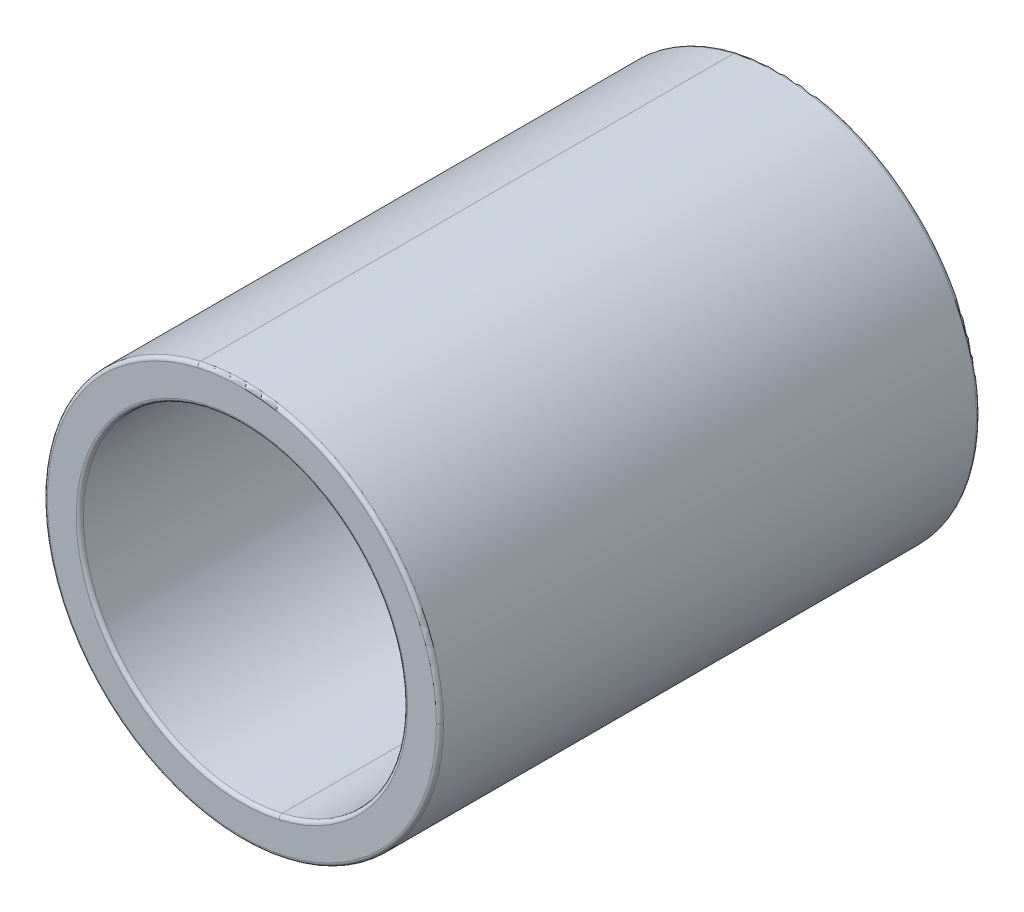
ISO-10303-21;
HEADER;
FILE_DESCRIPTION(('STEP AP214'),'2;1');
FILE_NAME('part.step','',(''),(''),'','','');
FILE_SCHEMA(('AUTOMOTIVE_DESIGN { 1 0 10303 214 1 1 1 1 }'));
ENDSEC;
DATA;
#1=APPLICATION_CONTEXT('core data for automotive mechanical design processes');
#2=APPLICATION_PROTOCOL_DEFINITION('international standard','automotive_design',2000,#1);
#3=PRODUCT_CONTEXT('',#1,'mechanical');
#4=PRODUCT('Part','Part','',(#3));
#5=PRODUCT_RELATED_PRODUCT_CATEGORY('part','',(#4));
#6=PRODUCT_DEFINITION_FORMATION('','',#4);
#7=PRODUCT_DEFINITION_CONTEXT('part definition',#1,'design');
#8=PRODUCT_DEFINITION('design','',#6,#7);
#9=PRODUCT_DEFINITION_SHAPE('','',#8);
#10=(LENGTH_UNIT() NAMED_UNIT(*) SI_UNIT(.MILLI.,.METRE.));
#11=(NAMED_UNIT(*) PLANE_ANGLE_UNIT() SI_UNIT($,.RADIAN.));
#12=(NAMED_UNIT(*) SI_UNIT($,.STERADIAN.) SOLID_ANGLE_UNIT());
#13=UNCERTAINTY_MEASURE_WITH_UNIT(LENGTH_MEASURE(1.E-05),#10,'distance_accuracy_value','');
#14=(GEOMETRIC_REPRESENTATION_CONTEXT(3) GLOBAL_UNCERTAINTY_ASSIGNED_CONTEXT((#13)) GLOBAL_UNIT_ASSIGNED_CONTEXT((#10,
#11,#12)) REPRESENTATION_CONTEXT('',''));
#15=CARTESIAN_POINT('',(0.,0.,0.));
#16=DIRECTION('',(0.,0.,1.));
#17=DIRECTION('',(1.,0.,0.));
#18=AXIS2_PLACEMENT_3D('',#15,#16,#17);
#19=CARTESIAN_POINT('',(-4.21485674493979,0.482044760346951,6.9450118369283));
#20=DIRECTION('',(0.,0.,1.));
#21=DIRECTION('',(1.,0.,0.));
#22=AXIS2_PLACEMENT_3D('',#19,#20,#21);
#23=PLANE('',#22);
#24=CARTESIAN_POINT('',(0.,0.,6.9450118369283));
#25=DIRECTION('',(0.,0.,1.));
#26=DIRECTION('',(0.999993907657791,0.00349065141521904,0.));
#27=AXIS2_PLACEMENT_3D('',#24,#25,#26);
#28=CIRCLE('',#27,5.50000000000044);
#29=CARTESIAN_POINT('',(-5.48726421207944,-0.374074146176042,6.9450118369283));
#30=VERTEX_POINT('',#29);
#31=CARTESIAN_POINT('',(-4.88370567628468,-2.52970726911823,6.9450118369283));
#32=VERTEX_POINT('',#31);
#33=EDGE_CURVE('E325',#30,#32,#28,.T.);
#34=ORIENTED_EDGE('',*,*,#33,.F.);
#35=DIRECTION('',(-0.978412700356879,0.206660561744034,0.));
#36=VECTOR('',#35,1.);
#37=CARTESIAN_POINT('',(-5.53807600239508,-0.363341667820007,6.9450118369283));
#38=LINE('',#37,#36);
#39=CARTESIAN_POINT('',(-5.58888779271072,-0.352609189463972,6.9450118369283));
#40=VERTEX_POINT('',#39);
#41=EDGE_CURVE('E11',#30,#40,#38,.T.);
#42=ORIENTED_EDGE('',*,*,#41,.T.);
#43=CARTESIAN_POINT('',(-4.85790093441127E-13,0.,6.9450118369283));
#44=DIRECTION('',(0.,0.,-1.));
#45=DIRECTION('',(-0.999993907657791,-0.00349065141521904,0.));
#46=AXIS2_PLACEMENT_3D('',#43,#44,#45);
#47=CIRCLE('',#46,5.6);
#48=CARTESIAN_POINT('',(-4.98417477235322,-2.55303776678734,6.9450118369283));
#49=VERTEX_POINT('',#48);
#50=EDGE_CURVE('E296',#49,#40,#47,.T.);
#51=ORIENTED_EDGE('',*,*,#50,.F.);
#52=DIRECTION('',(-0.974081576643637,-0.226196998307772,0.));
#53=VECTOR('',#52,1.);
#54=CARTESIAN_POINT('',(-4.93394022431895,-2.54137251795278,6.9450118369283));
#55=LINE('',#54,#53);
#56=EDGE_CURVE('E253',#32,#49,#55,.T.);
#57=ORIENTED_EDGE('',*,*,#56,.F.);
#58=EDGE_LOOP('',(#34,#42,#51,#57));
#59=FACE_BOUND('',#58,.T.);
#60=ADVANCED_FACE('F16',(#59),#23,.T.);
#61=CARTESIAN_POINT('',(-6.27113821296004,0.47486695480087,4.9450118369283));
#62=DIRECTION('',(0.,0.,-1.));
#63=DIRECTION('',(0.,-1.,0.));
#64=AXIS2_PLACEMENT_3D('',#61,#62,#63);
#65=PLANE('',#64);
#66=DIRECTION('',(0.974081576643637,0.226196998307772,0.));
#67=VECTOR('',#66,1.);
#68=CARTESIAN_POINT('',(-4.93394022431895,-2.54137251795278,4.9450118369283));
#69=LINE('',#68,#67);
#70=CARTESIAN_POINT('',(-4.98417477235322,-2.55303776678734,4.9450118369283));
#71=VERTEX_POINT('',#70);
#72=CARTESIAN_POINT('',(-4.88370567628468,-2.52970726911823,4.9450118369283));
#73=VERTEX_POINT('',#72);
#74=EDGE_CURVE('E266',#71,#73,#69,.T.);
#75=ORIENTED_EDGE('',*,*,#74,.F.);
#76=CARTESIAN_POINT('',(-4.85357172128634E-13,0.,4.9450118369283));
#77=DIRECTION('',(0.,0.,1.));
#78=DIRECTION('',(0.999993907657791,0.00349065141521904,0.));
#79=AXIS2_PLACEMENT_3D('',#76,#77,#78);
#80=CIRCLE('',#79,5.6);
#81=CARTESIAN_POINT('',(-5.58888779271072,-0.352609189463972,4.9450118369283));
#82=VERTEX_POINT('',#81);
#83=EDGE_CURVE('E19',#82,#71,#80,.T.);
#84=ORIENTED_EDGE('',*,*,#83,.F.);
#85=DIRECTION('',(0.978412700356879,-0.206660561744034,0.));
#86=VECTOR('',#85,1.);
#87=CARTESIAN_POINT('',(-5.53807600239508,-0.363341667820007,4.9450118369283));
#88=LINE('',#87,#86);
#89=CARTESIAN_POINT('',(-5.48726421207944,-0.374074146176042,4.9450118369283));
#90=VERTEX_POINT('',#89);
#91=EDGE_CURVE('E25',#82,#90,#88,.T.);
#92=ORIENTED_EDGE('',*,*,#91,.T.);
#93=CARTESIAN_POINT('',(-2.58160494515739E-13,0.,4.9450118369283));
#94=DIRECTION('',(0.,0.,-1.));
#95=DIRECTION('',(-0.999993907657791,-0.00349065141521904,0.));
#96=AXIS2_PLACEMENT_3D('',#93,#94,#95);
#97=CIRCLE('',#96,5.50000000000021);
#98=EDGE_CURVE('E337',#73,#90,#97,.T.);
#99=ORIENTED_EDGE('',*,*,#98,.F.);
#100=EDGE_LOOP('',(#75,#84,#92,#99));
#101=FACE_BOUND('',#100,.T.);
#102=ADVANCED_FACE('F418',(#101),#65,.T.);
#103=CARTESIAN_POINT('',(-4.76867384963161,-0.525854972317365,4.1354118369283));
#104=DIRECTION('',(0.206660561744051,0.978412700356876,0.));
#105=DIRECTION('',(0.,0.,-1.));
#106=AXIS2_PLACEMENT_3D('',#103,#104,#105);
#107=PLANE('',#106);
#108=DIRECTION('',(0.,0.,1.));
#109=VECTOR('',#108,1.);
#110=CARTESIAN_POINT('',(-5.48726421207944,-0.374074146176042,5.9450118369283));
#111=LINE('',#110,#109);
#112=EDGE_CURVE('E341',#90,#30,#111,.T.);
#113=ORIENTED_EDGE('',*,*,#112,.F.);
#114=ORIENTED_EDGE('',*,*,#91,.F.);
#115=DIRECTION('',(0.,0.,-1.));
#116=VECTOR('',#115,1.);
#117=CARTESIAN_POINT('',(-5.58888779271072,-0.352609189463972,5.9450118369283));
#118=LINE('',#117,#116);
#119=EDGE_CURVE('E406',#40,#82,#118,.T.);
#120=ORIENTED_EDGE('',*,*,#119,.F.);
#121=ORIENTED_EDGE('',*,*,#41,.F.);
#122=EDGE_LOOP('',(#113,#114,#120,#121));
#123=FACE_BOUND('',#122,.T.);
#124=ADVANCED_FACE('F425',(#123),#107,.T.);
#125=CARTESIAN_POINT('',(-4.61862460043944E-13,0.,5.9450118369283));
#126=DIRECTION('',(0.,0.,1.));
#127=DIRECTION('',(0.999993907657791,0.00349065141521904,0.));
#128=AXIS2_PLACEMENT_3D('',#125,#126,#127);
#129=CYLINDRICAL_SURFACE('',#128,5.6);
#130=ORIENTED_EDGE('',*,*,#50,.T.);
#131=ORIENTED_EDGE('',*,*,#119,.T.);
#132=ORIENTED_EDGE('',*,*,#83,.T.);
#133=DIRECTION('',(0.,0.,-1.));
#134=VECTOR('',#133,1.);
#135=CARTESIAN_POINT('',(-4.98417477235322,-2.55303776678734,5.9450118369283));
#136=LINE('',#135,#134);
#137=EDGE_CURVE('E257',#49,#71,#136,.T.);
#138=ORIENTED_EDGE('',*,*,#137,.F.);
#139=EDGE_LOOP('',(#130,#131,#132,#138));
#140=FACE_BOUND('',#139,.T.);
#141=ADVANCED_FACE('F415',(#140),#129,.T.);
#142=CARTESIAN_POINT('',(-4.16248771326453,-2.36222916228146,7.7546118369283));
#143=DIRECTION('',(0.226196998307849,-0.974081576643619,0.));
#144=DIRECTION('',(0.,0.,-1.));
#145=AXIS2_PLACEMENT_3D('',#142,#143,#144);
#146=PLANE('',#145);
#147=ORIENTED_EDGE('',*,*,#56,.T.);
#148=ORIENTED_EDGE('',*,*,#137,.T.);
#149=ORIENTED_EDGE('',*,*,#74,.T.);
#150=DIRECTION('',(0.,0.,-1.));
#151=VECTOR('',#150,1.);
#152=CARTESIAN_POINT('',(-4.88370567628468,-2.52970726911823,5.9450118369283));
#153=LINE('',#152,#151);
#154=EDGE_CURVE('E329',#32,#73,#153,.T.);
#155=ORIENTED_EDGE('',*,*,#154,.F.);
#156=EDGE_LOOP('',(#147,#148,#149,#155));
#157=FACE_BOUND('',#156,.T.);
#158=ADVANCED_FACE('F421',(#157),#146,.T.);
#159=CARTESIAN_POINT('',(-1.95927839561838,-2.37206766584673,6.9450118369283));
#160=DIRECTION('',(0.,0.,1.));
#161=DIRECTION('',(1.,0.,0.));
#162=AXIS2_PLACEMENT_3D('',#159,#160,#161);
#163=PLANE('',#162);
#164=DIRECTION('',(-0.818417823917914,-0.574623585918179,0.));
#165=VECTOR('',#164,1.);
#166=CARTESIAN_POINT('',(-4.54221892274483,-3.18916090184602,6.9450118369283));
#167=LINE('',#166,#165);
#168=CARTESIAN_POINT('',(-4.50129803154894,-3.16042972255011,6.9450118369283));
#169=VERTEX_POINT('',#168);
#170=CARTESIAN_POINT('',(-4.58313981394072,-3.21789208114193,6.9450118369283));
#171=VERTEX_POINT('',#170);
#172=EDGE_CURVE('E258',#169,#171,#167,.T.);
#173=ORIENTED_EDGE('',*,*,#172,.T.);
#174=CARTESIAN_POINT('',(-5.85591668265196E-13,-1.85684144379179E-13,6.9450118369282));
#175=DIRECTION('',(0.,0.,-1.));
#176=DIRECTION('',(-0.00349065141521904,0.999993907657791,0.));
#177=AXIS2_PLACEMENT_3D('',#174,#175,#176);
#178=CIRCLE('',#177,5.59999999999982);
#179=CARTESIAN_POINT('',(-2.79379534465086,-4.85331923246454,6.9450118369283));
#180=VERTEX_POINT('',#179);
#181=EDGE_CURVE('E242',#180,#171,#178,.T.);
#182=ORIENTED_EDGE('',*,*,#181,.F.);
#183=DIRECTION('',(-0.498892025830345,-0.866664148654422,0.));
#184=VECTOR('',#183,1.);
#185=CARTESIAN_POINT('',(-2.76885074335935,-4.80998602503182,6.9450118369283));
#186=LINE('',#185,#184);
#187=CARTESIAN_POINT('',(-2.74390614206783,-4.7666528175991,6.9450118369283));
#188=VERTEX_POINT('',#187);
#189=EDGE_CURVE('E248',#188,#180,#186,.T.);
#190=ORIENTED_EDGE('',*,*,#189,.F.);
#191=CARTESIAN_POINT('',(-5.13077365276168E-13,0.,6.9450118369282));
#192=DIRECTION('',(0.,0.,1.));
#193=DIRECTION('',(0.00349065141521904,-0.999993907657791,0.));
#194=AXIS2_PLACEMENT_3D('',#191,#192,#193);
#195=CIRCLE('',#194,5.49999999999994);
#196=EDGE_CURVE('E349',#169,#188,#195,.T.);
#197=ORIENTED_EDGE('',*,*,#196,.F.);
#198=EDGE_LOOP('',(#173,#182,#190,#197));
#199=FACE_BOUND('',#198,.T.);
#200=ADVANCED_FACE('F473',(#199),#163,.T.);
#201=CARTESIAN_POINT('',(-5.37903710048163,-2.38400492413543,4.9450118369283));
#202=DIRECTION('',(0.,0.,-1.));
#203=DIRECTION('',(0.,-1.,0.));
#204=AXIS2_PLACEMENT_3D('',#201,#202,#203);
#205=PLANE('',#204);
#206=CARTESIAN_POINT('',(-4.93197802962518E-13,0.,4.9450118369283));
#207=DIRECTION('',(0.,0.,-1.));
#208=DIRECTION('',(-0.999993907657791,-0.00349065141521904,0.));
#209=AXIS2_PLACEMENT_3D('',#206,#207,#208);
#210=CIRCLE('',#209,5.5);
#211=CARTESIAN_POINT('',(-2.74390614206783,-4.7666528175991,4.9450118369283));
#212=VERTEX_POINT('',#211);
#213=CARTESIAN_POINT('',(-4.50129803154894,-3.16042972255011,4.9450118369283));
#214=VERTEX_POINT('',#213);
#215=EDGE_CURVE('E333',#212,#214,#210,.T.);
#216=ORIENTED_EDGE('',*,*,#215,.F.);
#217=DIRECTION('',(0.498892025830345,0.866664148654422,0.));
#218=VECTOR('',#217,1.);
#219=CARTESIAN_POINT('',(-2.76885074335935,-4.80998602503182,4.9450118369283));
#220=LINE('',#219,#218);
#221=CARTESIAN_POINT('',(-2.79379534465086,-4.85331923246454,4.9450118369283));
#222=VERTEX_POINT('',#221);
#223=EDGE_CURVE('E240',#222,#212,#220,.T.);
#224=ORIENTED_EDGE('',*,*,#223,.F.);
#225=CARTESIAN_POINT('',(-5.85806993549888E-13,-1.8611857952041E-13,4.9450118369283));
#226=DIRECTION('',(0.,0.,1.));
#227=DIRECTION('',(0.999993907657791,0.00349065141521904,0.));
#228=AXIS2_PLACEMENT_3D('',#225,#226,#227);
#229=CIRCLE('',#228,5.59999999999981);
#230=CARTESIAN_POINT('',(-4.58313981394072,-3.21789208114193,4.9450118369283));
#231=VERTEX_POINT('',#230);
#232=EDGE_CURVE('E318',#231,#222,#229,.T.);
#233=ORIENTED_EDGE('',*,*,#232,.F.);
#234=DIRECTION('',(0.818417823917914,0.574623585918179,0.));
#235=VECTOR('',#234,1.);
#236=CARTESIAN_POINT('',(-4.54221892274483,-3.18916090184602,4.9450118369283));
#237=LINE('',#236,#235);
#238=EDGE_CURVE('E321',#231,#214,#237,.T.);
#239=ORIENTED_EDGE('',*,*,#238,.T.);
#240=EDGE_LOOP('',(#216,#224,#233,#239));
#241=FACE_BOUND('',#240,.T.);
#242=ADVANCED_FACE('F483',(#241),#205,.T.);
#243=CARTESIAN_POINT('',(-3.7985438433334,-2.66701533218617,4.1354118369283));
#244=DIRECTION('',(-0.574623585918191,0.818417823917906,0.));
#245=DIRECTION('',(0.,0.,1.));
#246=AXIS2_PLACEMENT_3D('',#243,#244,#245);
#247=PLANE('',#246);
#248=DIRECTION('',(0.,0.,1.));
#249=VECTOR('',#248,1.);
#250=CARTESIAN_POINT('',(-4.50129803154894,-3.16042972255011,5.9450118369283));
#251=LINE('',#250,#249);
#252=EDGE_CURVE('E345',#214,#169,#251,.T.);
#253=ORIENTED_EDGE('',*,*,#252,.F.);
#254=ORIENTED_EDGE('',*,*,#238,.F.);
#255=DIRECTION('',(0.,0.,-1.));
#256=VECTOR('',#255,1.);
#257=CARTESIAN_POINT('',(-4.58313981394072,-3.21789208114193,5.9450118369283));
#258=LINE('',#257,#256);
#259=EDGE_CURVE('E313',#171,#231,#258,.T.);
#260=ORIENTED_EDGE('',*,*,#259,.F.);
#261=ORIENTED_EDGE('',*,*,#172,.F.);
#262=EDGE_LOOP('',(#253,#254,#260,#261));
#263=FACE_BOUND('',#262,.T.);
#264=ADVANCED_FACE('F493',(#263),#247,.T.);
#265=CARTESIAN_POINT('',(-4.61862460043944E-13,0.,5.9450118369283));
#266=DIRECTION('',(0.,0.,1.));
#267=DIRECTION('',(0.999993907657791,0.00349065141521904,0.));
#268=AXIS2_PLACEMENT_3D('',#265,#266,#267);
#269=CYLINDRICAL_SURFACE('',#268,5.6);
#270=ORIENTED_EDGE('',*,*,#181,.T.);
#271=ORIENTED_EDGE('',*,*,#259,.T.);
#272=ORIENTED_EDGE('',*,*,#232,.T.);
#273=DIRECTION('',(0.,0.,-1.));
#274=VECTOR('',#273,1.);
#275=CARTESIAN_POINT('',(-2.79379534465086,-4.85331923246454,5.9450118369283));
#276=LINE('',#275,#274);
#277=EDGE_CURVE('E243',#180,#222,#276,.T.);
#278=ORIENTED_EDGE('',*,*,#277,.F.);
#279=EDGE_LOOP('',(#270,#271,#272,#278));
#280=FACE_BOUND('',#279,.T.);
#281=ADVANCED_FACE('F504',(#280),#269,.T.);
#282=CARTESIAN_POINT('',(-2.3232301310903,-4.03586379304758,7.7546118369283));
#283=DIRECTION('',(0.866664148654373,-0.498892025830431,0.));
#284=DIRECTION('',(0.,0.,-1.));
#285=AXIS2_PLACEMENT_3D('',#282,#283,#284);
#286=PLANE('',#285);
#287=ORIENTED_EDGE('',*,*,#189,.T.);
#288=ORIENTED_EDGE('',*,*,#277,.T.);
#289=ORIENTED_EDGE('',*,*,#223,.T.);
#290=DIRECTION('',(0.,0.,-1.));
#291=VECTOR('',#290,1.);
#292=CARTESIAN_POINT('',(-2.74390614206783,-4.7666528175991,5.9450118369283));
#293=LINE('',#292,#291);
#294=EDGE_CURVE('E353',#188,#212,#293,.T.);
#295=ORIENTED_EDGE('',*,*,#294,.F.);
#296=EDGE_LOOP('',(#287,#288,#289,#295));
#297=FACE_BOUND('',#296,.T.);
#298=ADVANCED_FACE('F515',(#297),#286,.T.);
#299=CARTESIAN_POINT('',(-4.5663110548259E-13,0.,9.8450118369283));
#300=DIRECTION('',(0.,0.,1.));
#301=DIRECTION('',(-0.999993907657791,-0.00349065141521904,0.));
#302=AXIS2_PLACEMENT_3D('',#299,#300,#301);
#303=TOROIDAL_SURFACE('',#302,5.4,0.100000000000003);
#304=CARTESIAN_POINT('',(-1.22146379086284,5.2600405138755,9.8450118369283));
#305=DIRECTION('',(-0.974081576643611,-0.226196998307883,0.));
#306=DIRECTION('',(0.226196998307883,-0.974081576643611,0.));
#307=AXIS2_PLACEMENT_3D('',#304,#305,#306);
#308=CIRCLE('',#307,0.100000000000007);
#309=CARTESIAN_POINT('',(-1.22146379086284,5.2600405138755,9.9450118369283));
#310=VERTEX_POINT('',#309);
#311=CARTESIAN_POINT('',(-1.24408349069363,5.35744867153986,9.8450118369283));
#312=VERTEX_POINT('',#311);
#313=EDGE_CURVE('E945',#310,#312,#308,.T.);
#314=ORIENTED_EDGE('',*,*,#313,.F.);
#315=CARTESIAN_POINT('',(-4.52439437979322E-13,0.,9.9450118369283));
#316=DIRECTION('',(0.,0.,-1.));
#317=DIRECTION('',(-0.00349065141521904,0.999993907657791,0.));
#318=AXIS2_PLACEMENT_3D('',#315,#316,#317);
#319=CIRCLE('',#318,5.4);
#320=CARTESIAN_POINT('',(5.39996710135162,0.0188495176421365,9.9450118369283));
#321=VERTEX_POINT('',#320);
#322=EDGE_CURVE('E208',#310,#321,#319,.T.);
#323=ORIENTED_EDGE('',*,*,#322,.T.);
#324=CARTESIAN_POINT('',(5.39996710135162,0.018849517642141,9.8450118369283));
#325=DIRECTION('',(0.00349065141521904,-0.999993907657791,0.));
#326=DIRECTION('',(0.,0.,-1.));
#327=AXIS2_PLACEMENT_3D('',#324,#325,#326);
#328=CIRCLE('',#327,0.0999999999999893);
#329=CARTESIAN_POINT('',(5.4999664921174,0.0191985827836629,9.8450118369283));
#330=VERTEX_POINT('',#329);
#331=EDGE_CURVE('E245',#330,#321,#328,.T.);
#332=ORIENTED_EDGE('',*,*,#331,.F.);
#333=CARTESIAN_POINT('',(-4.78040619487024E-13,0.,9.8450118369283));
#334=DIRECTION('',(0.,0.,1.));
#335=DIRECTION('',(0.999993907657791,0.00349065141521904,0.));
#336=AXIS2_PLACEMENT_3D('',#333,#334,#335);
#337=CIRCLE('',#336,5.5);
#338=EDGE_CURVE('E377',#330,#312,#337,.T.);
#339=ORIENTED_EDGE('',*,*,#338,.T.);
#340=EDGE_LOOP('',(#314,#323,#332,#339));
#341=FACE_BOUND('',#340,.T.);
#342=ADVANCED_FACE('F526',(#341),#303,.T.);
#343=CARTESIAN_POINT('',(-4.5663110548259E-13,0.,9.8450118369283));
#344=DIRECTION('',(0.,0.,1.));
#345=DIRECTION('',(-0.999993907657791,-0.00349065141521904,0.));
#346=AXIS2_PLACEMENT_3D('',#343,#344,#345);
#347=TOROIDAL_SURFACE('',#346,5.4,0.100000000000003);
#348=CARTESIAN_POINT('',(1.22146379086193,-5.26004051387559,9.8450118369283));
#349=DIRECTION('',(-0.974081576643638,-0.226196998307769,0.));
#350=DIRECTION('',(0.226196998307769,-0.974081576643638,0.));
#351=AXIS2_PLACEMENT_3D('',#348,#349,#350);
#352=CIRCLE('',#351,0.1);
#353=CARTESIAN_POINT('',(1.2440834906927,-5.35744867153996,9.8450118369283));
#354=VERTEX_POINT('',#353);
#355=CARTESIAN_POINT('',(1.22146379086193,-5.26004051387559,9.9450118369283));
#356=VERTEX_POINT('',#355);
#357=EDGE_CURVE('E225',#354,#356,#352,.T.);
#358=ORIENTED_EDGE('',*,*,#357,.F.);
#359=CARTESIAN_POINT('',(-4.62562418631239E-13,0.,9.8450118369283));
#360=DIRECTION('',(0.,0.,1.));
#361=DIRECTION('',(0.999993907657791,0.00349065141521904,0.));
#362=AXIS2_PLACEMENT_3D('',#359,#360,#361);
#363=CIRCLE('',#362,5.5);
#364=EDGE_CURVE('E382',#354,#330,#363,.T.);
#365=ORIENTED_EDGE('',*,*,#364,.T.);
#366=ORIENTED_EDGE('',*,*,#331,.T.);
#367=CARTESIAN_POINT('',(-4.52611552536485E-13,0.,9.9450118369283));
#368=DIRECTION('',(0.,0.,-1.));
#369=DIRECTION('',(-0.999993907657791,-0.00349065141521904,0.));
#370=AXIS2_PLACEMENT_3D('',#367,#368,#369);
#371=CIRCLE('',#370,5.4);
#372=EDGE_CURVE('E330',#321,#356,#371,.T.);
#373=ORIENTED_EDGE('',*,*,#372,.T.);
#374=EDGE_LOOP('',(#358,#365,#366,#373));
#375=FACE_BOUND('',#374,.T.);
#376=ADVANCED_FACE('F669',(#375),#347,.T.);
#377=CARTESIAN_POINT('',(-4.62688055792132E-13,0.,9.8450118369283));
#378=DIRECTION('',(0.,0.,1.));
#379=DIRECTION('',(-0.999993907657791,-0.00349065141521904,0.));
#380=AXIS2_PLACEMENT_3D('',#377,#378,#379);
#381=TOROIDAL_SURFACE('',#380,4.6,0.1);
#382=CARTESIAN_POINT('',(-4.59332051224106E-13,0.,9.9450118369283));
#383=DIRECTION('',(0.,0.,1.));
#384=DIRECTION('',(0.999993907657791,0.00349065141521904,0.));
#385=AXIS2_PLACEMENT_3D('',#382,#383,#384);
#386=CIRCLE('',#385,4.6);
#387=CARTESIAN_POINT('',(1.04050619221564,-4.4807752525607,9.9450118369283));
#388=VERTEX_POINT('',#387);
#389=CARTESIAN_POINT('',(4.59997197522538,0.0160569965099613,9.9450118369283));
#390=VERTEX_POINT('',#389);
#391=EDGE_CURVE('E207',#388,#390,#386,.T.);
#392=ORIENTED_EDGE('',*,*,#391,.T.);
#393=CARTESIAN_POINT('',(4.59997197522538,0.0160569965099613,9.8450118369283));
#394=DIRECTION('',(0.003490651415223,-0.999993907657791,0.));
#395=DIRECTION('',(0.999993907657791,0.003490651415223,0.));
#396=AXIS2_PLACEMENT_3D('',#393,#394,#395);
#397=CIRCLE('',#396,0.1);
#398=CARTESIAN_POINT('',(4.4999725844596,0.0157079313684374,9.8450118369283));
#399=VERTEX_POINT('',#398);
#400=EDGE_CURVE('E202',#390,#399,#397,.T.);
#401=ORIENTED_EDGE('',*,*,#400,.T.);
#402=CARTESIAN_POINT('',(-4.71840791941909E-13,0.,9.8450118369283));
#403=DIRECTION('',(0.,0.,-1.));
#404=DIRECTION('',(-0.999993907657791,-0.00349065141521904,0.));
#405=AXIS2_PLACEMENT_3D('',#402,#403,#404);
#406=CIRCLE('',#405,4.5);
#407=CARTESIAN_POINT('',(1.01788649238485,-4.38336709489633,9.8450118369283));
#408=VERTEX_POINT('',#407);
#409=EDGE_CURVE('E300',#399,#408,#406,.T.);
#410=ORIENTED_EDGE('',*,*,#409,.T.);
#411=CARTESIAN_POINT('',(1.04050619221563,-4.4807752525607,9.8450118369283));
#412=DIRECTION('',(-0.974081576643638,-0.226196998307768,0.));
#413=DIRECTION('',(0.226196998307768,-0.974081576643638,0.));
#414=AXIS2_PLACEMENT_3D('',#411,#412,#413);
#415=CIRCLE('',#414,0.100000000000003);
#416=EDGE_CURVE('E224',#388,#408,#415,.T.);
#417=ORIENTED_EDGE('',*,*,#416,.F.);
#418=EDGE_LOOP('',(#392,#401,#410,#417));
#419=FACE_BOUND('',#418,.T.);
#420=ADVANCED_FACE('F680',(#419),#381,.T.);
#421=CARTESIAN_POINT('',(-4.62688055792132E-13,0.,9.8450118369283));
#422=DIRECTION('',(0.,0.,1.));
#423=DIRECTION('',(-0.999993907657791,-0.00349065141521904,0.));
#424=AXIS2_PLACEMENT_3D('',#421,#422,#423);
#425=TOROIDAL_SURFACE('',#424,4.6,0.1);
#426=CARTESIAN_POINT('',(-4.62681770375207E-13,0.,9.8450118369283));
#427=DIRECTION('',(0.,0.,-1.));
#428=DIRECTION('',(-0.999993907657791,-0.00349065141521904,0.));
#429=AXIS2_PLACEMENT_3D('',#426,#427,#428);
#430=CIRCLE('',#429,4.5);
#431=CARTESIAN_POINT('',(-1.01788649238578,4.38336709489624,9.8450118369283));
#432=VERTEX_POINT('',#431);
#433=EDGE_CURVE('E303',#432,#399,#430,.T.);
#434=ORIENTED_EDGE('',*,*,#433,.T.);
#435=ORIENTED_EDGE('',*,*,#400,.F.);
#436=CARTESIAN_POINT('',(-4.77867895576297E-13,0.,9.9450118369283));
#437=DIRECTION('',(0.,0.,1.));
#438=DIRECTION('',(0.999993907657791,0.00349065141521904,0.));
#439=AXIS2_PLACEMENT_3D('',#436,#437,#438);
#440=CIRCLE('',#439,4.6);
#441=CARTESIAN_POINT('',(-1.04050619221657,4.4807752525606,9.9450118369283));
#442=VERTEX_POINT('',#441);
#443=EDGE_CURVE('E196',#390,#442,#440,.T.);
#444=ORIENTED_EDGE('',*,*,#443,.T.);
#445=CARTESIAN_POINT('',(-1.04050619221657,4.4807752525606,9.8450118369283));
#446=DIRECTION('',(-0.974081576643621,-0.226196998307841,0.));
#447=DIRECTION('',(0.226196998307841,-0.974081576643621,0.));
#448=AXIS2_PLACEMENT_3D('',#445,#446,#447);
#449=CIRCLE('',#448,0.0999999999999958);
#450=EDGE_CURVE('E200',#432,#442,#449,.T.);
#451=ORIENTED_EDGE('',*,*,#450,.F.);
#452=EDGE_LOOP('',(#434,#435,#444,#451));
#453=FACE_BOUND('',#452,.T.);
#454=ADVANCED_FACE('F199',(#453),#425,.T.);
#455=CARTESIAN_POINT('',(-4.5663110548259E-13,0.,-4.95498816307167));
#456=DIRECTION('',(0.,0.,1.));
#457=DIRECTION('',(-0.00349065141521904,0.999993907657791,0.));
#458=AXIS2_PLACEMENT_3D('',#455,#456,#457);
#459=TOROIDAL_SURFACE('',#458,5.4,0.100000000000003);
#460=CARTESIAN_POINT('',(-4.52508098338033E-13,0.,-5.05498816307167));
#461=DIRECTION('',(0.,0.,1.));
#462=DIRECTION('',(0.999993907657791,0.00349065141521904,0.));
#463=AXIS2_PLACEMENT_3D('',#460,#461,#462);
#464=CIRCLE('',#463,5.4);
#465=CARTESIAN_POINT('',(1.22146379086193,-5.26004051387559,-5.05498816307167));
#466=VERTEX_POINT('',#465);
#467=CARTESIAN_POINT('',(5.39996710135162,0.0188495176421376,-5.05498816307167));
#468=VERTEX_POINT('',#467);
#469=EDGE_CURVE('E363',#466,#468,#464,.T.);
#470=ORIENTED_EDGE('',*,*,#469,.T.);
#471=CARTESIAN_POINT('',(5.39996710135162,0.0188495176421377,-4.95498816307167));
#472=DIRECTION('',(0.00349065141523855,-0.99999390765779,0.));
#473=DIRECTION('',(0.99999390765779,0.00349065141523855,0.));
#474=AXIS2_PLACEMENT_3D('',#471,#472,#473);
#475=CIRCLE('',#474,0.1);
#476=CARTESIAN_POINT('',(5.49996649211738,0.0191985827836624,-4.95498816307167));
#477=VERTEX_POINT('',#476);
#478=EDGE_CURVE('E275',#468,#477,#475,.T.);
#479=ORIENTED_EDGE('',*,*,#478,.T.);
#480=CARTESIAN_POINT('',(-4.64286503484318E-13,0.,-4.95498816307167));
#481=DIRECTION('',(0.,0.,1.));
#482=DIRECTION('',(0.999993907657791,0.00349065141521904,0.));
#483=AXIS2_PLACEMENT_3D('',#480,#481,#482);
#484=CIRCLE('',#483,5.5);
#485=CARTESIAN_POINT('',(1.2440834906927,-5.35744867153996,-4.95498816307167));
#486=VERTEX_POINT('',#485);
#487=EDGE_CURVE('E386',#486,#477,#484,.T.);
#488=ORIENTED_EDGE('',*,*,#487,.F.);
#489=CARTESIAN_POINT('',(1.22146379086193,-5.26004051387559,-4.95498816307167));
#490=DIRECTION('',(-0.974081576643638,-0.22619699830777,0.));
#491=DIRECTION('',(0.22619699830777,-0.974081576643638,0.));
#492=AXIS2_PLACEMENT_3D('',#489,#490,#491);
#493=CIRCLE('',#492,0.1);
#494=EDGE_CURVE('E252',#466,#486,#493,.T.);
#495=ORIENTED_EDGE('',*,*,#494,.F.);
#496=EDGE_LOOP('',(#470,#479,#488,#495));
#497=FACE_BOUND('',#496,.T.);
#498=ADVANCED_FACE('F686',(#497),#459,.T.);
#499=CARTESIAN_POINT('',(-4.5663110548259E-13,0.,-4.95498816307167));
#500=DIRECTION('',(0.,0.,1.));
#501=DIRECTION('',(-0.00349065141521904,0.999993907657791,0.));
#502=AXIS2_PLACEMENT_3D('',#499,#500,#501);
#503=TOROIDAL_SURFACE('',#502,5.4,0.100000000000003);
#504=CARTESIAN_POINT('',(-1.22146379086284,5.2600405138755,-4.95498816307166));
#505=DIRECTION('',(-0.974081576643611,-0.226196998307883,0.));
#506=DIRECTION('',(0.226196998307883,-0.974081576643611,0.));
#507=AXIS2_PLACEMENT_3D('',#504,#505,#506);
#508=CIRCLE('',#507,0.100000000000006);
#509=CARTESIAN_POINT('',(-1.24408349069363,5.35744867153986,-4.95498816307167));
#510=VERTEX_POINT('',#509);
#511=CARTESIAN_POINT('',(-1.22146379086284,5.2600405138755,-5.05498816307167));
#512=VERTEX_POINT('',#511);
#513=EDGE_CURVE('E270',#510,#512,#508,.T.);
#514=ORIENTED_EDGE('',*,*,#513,.F.);
#515=CARTESIAN_POINT('',(-4.41681892764011E-13,0.,-4.95498816307167));
#516=DIRECTION('',(0.,0.,1.));
#517=DIRECTION('',(0.999993907657791,0.00349065141521904,0.));
#518=AXIS2_PLACEMENT_3D('',#515,#516,#517);
#519=CIRCLE('',#518,5.5);
#520=EDGE_CURVE('E370',#477,#510,#519,.T.);
#521=ORIENTED_EDGE('',*,*,#520,.F.);
#522=ORIENTED_EDGE('',*,*,#478,.F.);
#523=CARTESIAN_POINT('',(-4.60964823761841E-13,0.,-5.05498816307167));
#524=DIRECTION('',(0.,0.,1.));
#525=DIRECTION('',(0.999993907657791,0.00349065141521904,0.));
#526=AXIS2_PLACEMENT_3D('',#523,#524,#525);
#527=CIRCLE('',#526,5.4);
#528=EDGE_CURVE('E360',#468,#512,#527,.T.);
#529=ORIENTED_EDGE('',*,*,#528,.T.);
#530=EDGE_LOOP('',(#514,#521,#522,#529));
#531=FACE_BOUND('',#530,.T.);
#532=ADVANCED_FACE('F691',(#531),#503,.T.);
#533=CARTESIAN_POINT('',(-4.62696472679921E-13,0.,-4.95498816307167));
#534=DIRECTION('',(0.,0.,1.));
#535=DIRECTION('',(-0.999993907657791,-0.00349065141521904,0.));
#536=AXIS2_PLACEMENT_3D('',#533,#534,#535);
#537=TOROIDAL_SURFACE('',#536,4.6,0.1);
#538=CARTESIAN_POINT('',(-4.52499293910087E-13,0.,-4.95498816307167));
#539=DIRECTION('',(0.,0.,1.));
#540=DIRECTION('',(0.999993907657791,0.00349065141521904,0.));
#541=AXIS2_PLACEMENT_3D('',#538,#539,#540);
#542=CIRCLE('',#541,4.5);
#543=CARTESIAN_POINT('',(1.01788649238485,-4.38336709489633,-4.95498816307167));
#544=VERTEX_POINT('',#543);
#545=CARTESIAN_POINT('',(4.4999725844596,0.015707931368438,-4.95498816307167));
#546=VERTEX_POINT('',#545);
#547=EDGE_CURVE('E288',#544,#546,#542,.T.);
#548=ORIENTED_EDGE('',*,*,#547,.T.);
#549=CARTESIAN_POINT('',(4.59997197522538,0.0160569965099599,-4.95498816307167));
#550=DIRECTION('',(0.00349065141521904,-0.999993907657791,0.));
#551=DIRECTION('',(0.,0.,-1.));
#552=AXIS2_PLACEMENT_3D('',#549,#550,#551);
#553=CIRCLE('',#552,0.1);
#554=CARTESIAN_POINT('',(4.59997197522538,0.0160569965099602,-5.05498816307167));
#555=VERTEX_POINT('',#554);
#556=EDGE_CURVE('E278',#546,#555,#553,.T.);
#557=ORIENTED_EDGE('',*,*,#556,.T.);
#558=CARTESIAN_POINT('',(-4.59220180137865E-13,0.,-5.05498816307167));
#559=DIRECTION('',(0.,0.,-1.));
#560=DIRECTION('',(-0.999993907657791,-0.00349065141521904,0.));
#561=AXIS2_PLACEMENT_3D('',#558,#559,#560);
#562=CIRCLE('',#561,4.6);
#563=CARTESIAN_POINT('',(1.04050619221564,-4.4807752525607,-5.05498816307167));
#564=VERTEX_POINT('',#563);
#565=EDGE_CURVE('E367',#555,#564,#562,.T.);
#566=ORIENTED_EDGE('',*,*,#565,.T.);
#567=CARTESIAN_POINT('',(1.04050619221564,-4.4807752525607,-4.95498816307167));
#568=DIRECTION('',(-0.974081576643616,-0.226196998307864,0.));
#569=DIRECTION('',(0.226196998307864,-0.974081576643616,0.));
#570=AXIS2_PLACEMENT_3D('',#567,#568,#569);
#571=CIRCLE('',#570,0.1);
#572=EDGE_CURVE('E279',#544,#564,#571,.T.);
#573=ORIENTED_EDGE('',*,*,#572,.F.);
#574=EDGE_LOOP('',(#548,#557,#566,#573));
#575=FACE_BOUND('',#574,.T.);
#576=ADVANCED_FACE('F710',(#575),#537,.T.);
#577=CARTESIAN_POINT('',(-4.62696472679921E-13,0.,-4.95498816307167));
#578=DIRECTION('',(0.,0.,1.));
#579=DIRECTION('',(-0.999993907657791,-0.00349065141521904,0.));
#580=AXIS2_PLACEMENT_3D('',#577,#578,#579);
#581=TOROIDAL_SURFACE('',#580,4.6,0.1);
#582=CARTESIAN_POINT('',(-4.54146145055096E-13,0.,-5.05498816307167));
#583=DIRECTION('',(0.,0.,-1.));
#584=DIRECTION('',(-0.999993907657791,-0.00349065141521904,0.));
#585=AXIS2_PLACEMENT_3D('',#582,#583,#584);
#586=CIRCLE('',#585,4.6);
#587=CARTESIAN_POINT('',(-1.04050619221657,4.4807752525606,-5.05498816307167));
#588=VERTEX_POINT('',#587);
#589=EDGE_CURVE('E373',#588,#555,#586,.T.);
#590=ORIENTED_EDGE('',*,*,#589,.T.);
#591=ORIENTED_EDGE('',*,*,#556,.F.);
#592=CARTESIAN_POINT('',(-4.60956019333895E-13,0.,-4.95498816307166));
#593=DIRECTION('',(0.,0.,1.));
#594=DIRECTION('',(0.999993907657791,0.00349065141521904,0.));
#595=AXIS2_PLACEMENT_3D('',#592,#593,#594);
#596=CIRCLE('',#595,4.5);
#597=CARTESIAN_POINT('',(-1.01788649238578,4.38336709489624,-4.95498816307167));
#598=VERTEX_POINT('',#597);
#599=EDGE_CURVE('E284',#546,#598,#596,.T.);
#600=ORIENTED_EDGE('',*,*,#599,.T.);
#601=CARTESIAN_POINT('',(-1.04050619221657,4.4807752525606,-4.95498816307167));
#602=DIRECTION('',(-0.974081576643616,-0.226196998307862,0.));
#603=DIRECTION('',(0.226196998307862,-0.974081576643616,0.));
#604=AXIS2_PLACEMENT_3D('',#601,#602,#603);
#605=CIRCLE('',#604,0.100000000000002);
#606=EDGE_CURVE('E289',#588,#598,#605,.T.);
#607=ORIENTED_EDGE('',*,*,#606,.F.);
#608=EDGE_LOOP('',(#590,#591,#600,#607));
#609=FACE_BOUND('',#608,.T.);
#610=ADVANCED_FACE('F719',(#609),#581,.T.);
#611=CARTESIAN_POINT('',(-4.62176476622573E-13,0.,2.4450118369283));
#612=DIRECTION('',(0.,0.,-1.));
#613=DIRECTION('',(-0.999993907657791,-0.00349065141521904,0.));
#614=AXIS2_PLACEMENT_3D('',#611,#612,#613);
#615=CYLINDRICAL_SURFACE('',#614,4.5);
#616=DIRECTION('',(0.,0.,1.));
#617=VECTOR('',#616,1.);
#618=CARTESIAN_POINT('',(1.01788649238485,-4.38336709489633,2.4450118369283));
#619=LINE('',#618,#617);
#620=EDGE_CURVE('E293',#544,#408,#619,.T.);
#621=ORIENTED_EDGE('',*,*,#620,.F.);
#622=CARTESIAN_POINT('',(-4.50565650483192E-13,0.,-4.95498816307167));
#623=DIRECTION('',(0.,0.,1.));
#624=DIRECTION('',(0.999993907657791,0.00349065141521904,0.));
#625=AXIS2_PLACEMENT_3D('',#622,#623,#624);
#626=CIRCLE('',#625,4.5);
#627=EDGE_CURVE('E274',#598,#544,#626,.T.);
#628=ORIENTED_EDGE('',*,*,#627,.F.);
#629=DIRECTION('',(0.,0.,1.));
#630=VECTOR('',#629,1.);
#631=CARTESIAN_POINT('',(-1.01788649238578,4.38336709489624,2.4450118369283));
#632=LINE('',#631,#630);
#633=EDGE_CURVE('E306',#598,#432,#632,.T.);
#634=ORIENTED_EDGE('',*,*,#633,.T.);
#635=CARTESIAN_POINT('',(-4.69089499479779E-13,0.,9.8450118369283));
#636=DIRECTION('',(0.,0.,-1.));
#637=DIRECTION('',(-0.999993907657791,-0.00349065141521904,0.));
#638=AXIS2_PLACEMENT_3D('',#635,#636,#637);
#639=CIRCLE('',#638,4.5);
#640=EDGE_CURVE('E216',#408,#432,#639,.T.);
#641=ORIENTED_EDGE('',*,*,#640,.F.);
#642=EDGE_LOOP('',(#621,#628,#634,#641));
#643=FACE_BOUND('',#642,.T.);
#644=ADVANCED_FACE('F728',(#643),#615,.F.);
#645=CARTESIAN_POINT('',(-4.62176476622573E-13,0.,2.4450118369283));
#646=DIRECTION('',(0.,0.,-1.));
#647=DIRECTION('',(-0.999993907657791,-0.00349065141521904,0.));
#648=AXIS2_PLACEMENT_3D('',#645,#646,#647);
#649=CYLINDRICAL_SURFACE('',#648,5.5);
#650=DIRECTION('',(0.,0.,-1.));
#651=VECTOR('',#650,1.);
#652=CARTESIAN_POINT('',(-1.24408349069363,5.35744867153986,2.4450118369283));
#653=LINE('',#652,#651);
#654=EDGE_CURVE('E317',#312,#510,#653,.T.);
#655=ORIENTED_EDGE('',*,*,#654,.F.);
#656=ORIENTED_EDGE('',*,*,#338,.F.);
#657=ORIENTED_EDGE('',*,*,#364,.F.);
#658=DIRECTION('',(0.,0.,1.));
#659=VECTOR('',#658,1.);
#660=CARTESIAN_POINT('',(1.2440834906927,-5.35744867153996,2.4450118369283));
#661=LINE('',#660,#659);
#662=EDGE_CURVE('E309',#486,#354,#661,.T.);
#663=ORIENTED_EDGE('',*,*,#662,.F.);
#664=ORIENTED_EDGE('',*,*,#487,.T.);
#665=ORIENTED_EDGE('',*,*,#520,.T.);
#666=EDGE_LOOP('',(#655,#656,#657,#663,#664,#665));
#667=FACE_BOUND('',#666,.T.);
#668=ADVANCED_FACE('F739',(#667),#649,.T.);
#669=CARTESIAN_POINT('',(-8.39960836072682,8.34117177683162,-5.05498816307167));
#670=DIRECTION('',(0.,0.,-1.));
#671=DIRECTION('',(0.,-1.,0.));
#672=AXIS2_PLACEMENT_3D('',#669,#670,#671);
#673=PLANE('',#672);
#674=CARTESIAN_POINT('',(-4.63024816533038E-13,0.,-5.05498816307167));
#675=DIRECTION('',(0.,0.,-1.));
#676=DIRECTION('',(-0.999993907657791,-0.00349065141521904,0.));
#677=AXIS2_PLACEMENT_3D('',#674,#675,#676);
#678=CIRCLE('',#677,4.6);
#679=EDGE_CURVE('E282',#564,#588,#678,.T.);
#680=ORIENTED_EDGE('',*,*,#679,.F.);
#681=ORIENTED_EDGE('',*,*,#565,.F.);
#682=ORIENTED_EDGE('',*,*,#589,.F.);
#683=EDGE_LOOP('',(#680,#681,#682));
#684=FACE_BOUND('',#683,.T.);
#685=ORIENTED_EDGE('',*,*,#528,.F.);
#686=ORIENTED_EDGE('',*,*,#469,.F.);
#687=CARTESIAN_POINT('',(-4.55574143694452E-13,0.,-5.05498816307167));
#688=DIRECTION('',(0.,0.,1.));
#689=DIRECTION('',(0.999993907657791,0.00349065141521904,0.));
#690=AXIS2_PLACEMENT_3D('',#687,#688,#689);
#691=CIRCLE('',#690,5.4);
#692=EDGE_CURVE('E218',#512,#466,#691,.T.);
#693=ORIENTED_EDGE('',*,*,#692,.F.);
#694=EDGE_LOOP('',(#685,#686,#693));
#695=FACE_BOUND('',#694,.T.);
#696=ADVANCED_FACE('F734',(#684,#695),#673,.T.);
#697=CARTESIAN_POINT('',(8.3411717768312,8.39960836072632,9.9450118369283));
#698=DIRECTION('',(0.,0.,1.));
#699=DIRECTION('',(1.,0.,0.));
#700=AXIS2_PLACEMENT_3D('',#697,#698,#699);
#701=PLANE('',#700);
#702=CARTESIAN_POINT('',(-4.49481833373222E-13,0.,9.9450118369283));
#703=DIRECTION('',(0.,0.,1.));
#704=DIRECTION('',(0.999993907657791,0.00349065141521904,0.));
#705=AXIS2_PLACEMENT_3D('',#702,#703,#704);
#706=CIRCLE('',#705,4.6);
#707=EDGE_CURVE('E214',#442,#388,#706,.T.);
#708=ORIENTED_EDGE('',*,*,#707,.F.);
#709=ORIENTED_EDGE('',*,*,#443,.F.);
#710=ORIENTED_EDGE('',*,*,#391,.F.);
#711=EDGE_LOOP('',(#708,#709,#710));
#712=FACE_BOUND('',#711,.T.);
#713=ORIENTED_EDGE('',*,*,#372,.F.);
#714=ORIENTED_EDGE('',*,*,#322,.F.);
#715=CARTESIAN_POINT('',(-4.57099208174979E-13,0.,9.9450118369283));
#716=DIRECTION('',(0.,0.,-1.));
#717=DIRECTION('',(-0.999993907657791,-0.00349065141521904,0.));
#718=AXIS2_PLACEMENT_3D('',#715,#716,#717);
#719=CIRCLE('',#718,5.4);
#720=EDGE_CURVE('E949',#356,#310,#719,.T.);
#721=ORIENTED_EDGE('',*,*,#720,.F.);
#722=EDGE_LOOP('',(#713,#714,#721));
#723=FACE_BOUND('',#722,.T.);
#724=ADVANCED_FACE('F220',(#712,#723),#701,.T.);
#725=CARTESIAN_POINT('',(-4.62018920268712E-13,0.,2.4450118369283));
#726=DIRECTION('',(0.,0.,-1.));
#727=DIRECTION('',(-0.999993907657791,-0.00349065141521904,0.));
#728=AXIS2_PLACEMENT_3D('',#725,#726,#727);
#729=CYLINDRICAL_SURFACE('',#728,5.5);
#730=ORIENTED_EDGE('',*,*,#252,.T.);
#731=ORIENTED_EDGE('',*,*,#196,.T.);
#732=ORIENTED_EDGE('',*,*,#294,.T.);
#733=ORIENTED_EDGE('',*,*,#215,.T.);
#734=EDGE_LOOP('',(#730,#731,#732,#733));
#735=FACE_BOUND('',#734,.T.);
#736=ORIENTED_EDGE('',*,*,#33,.T.);
#737=ORIENTED_EDGE('',*,*,#154,.T.);
#738=ORIENTED_EDGE('',*,*,#98,.T.);
#739=ORIENTED_EDGE('',*,*,#112,.T.);
#740=EDGE_LOOP('',(#736,#737,#738,#739));
#741=FACE_BOUND('',#740,.T.);
#742=ORIENTED_EDGE('',*,*,#662,.T.);
#743=CARTESIAN_POINT('',(-4.50132729170699E-13,0.,9.8450118369283));
#744=DIRECTION('',(0.,0.,1.));
#745=DIRECTION('',(0.999993907657791,0.00349065141521904,0.));
#746=AXIS2_PLACEMENT_3D('',#743,#744,#745);
#747=CIRCLE('',#746,5.5);
#748=EDGE_CURVE('E235',#312,#354,#747,.T.);
#749=ORIENTED_EDGE('',*,*,#748,.F.);
#750=ORIENTED_EDGE('',*,*,#654,.T.);
#751=CARTESIAN_POINT('',(-4.50132729170699E-13,0.,-4.95498816307167));
#752=DIRECTION('',(0.,0.,1.));
#753=DIRECTION('',(0.999993907657791,0.00349065141521904,0.));
#754=AXIS2_PLACEMENT_3D('',#751,#752,#753);
#755=CIRCLE('',#754,5.5);
#756=EDGE_CURVE('E262',#510,#486,#755,.T.);
#757=ORIENTED_EDGE('',*,*,#756,.T.);
#758=EDGE_LOOP('',(#742,#749,#750,#757));
#759=FACE_BOUND('',#758,.T.);
#760=ADVANCED_FACE('F423',(#735,#741,#759),#729,.T.);
#761=CARTESIAN_POINT('',(-4.61861363914852E-13,0.,2.4450118369283));
#762=DIRECTION('',(0.,0.,-1.));
#763=DIRECTION('',(-0.999993907657791,-0.00349065141521904,0.));
#764=AXIS2_PLACEMENT_3D('',#761,#762,#763);
#765=CYLINDRICAL_SURFACE('',#764,4.5);
#766=ORIENTED_EDGE('',*,*,#599,.F.);
#767=ORIENTED_EDGE('',*,*,#547,.F.);
#768=ORIENTED_EDGE('',*,*,#620,.T.);
#769=ORIENTED_EDGE('',*,*,#409,.F.);
#770=ORIENTED_EDGE('',*,*,#433,.F.);
#771=ORIENTED_EDGE('',*,*,#633,.F.);
#772=EDGE_LOOP('',(#766,#767,#768,#769,#770,#771));
#773=FACE_BOUND('',#772,.T.);
#774=ADVANCED_FACE('F763',(#773),#765,.F.);
#775=CARTESIAN_POINT('',(-4.62696472679921E-13,0.,-4.95498816307167));
#776=DIRECTION('',(0.,0.,1.));
#777=DIRECTION('',(-0.999993907657791,-0.00349065141521904,0.));
#778=AXIS2_PLACEMENT_3D('',#775,#776,#777);
#779=TOROIDAL_SURFACE('',#778,4.6,0.1);
#780=ORIENTED_EDGE('',*,*,#627,.T.);
#781=ORIENTED_EDGE('',*,*,#572,.T.);
#782=ORIENTED_EDGE('',*,*,#679,.T.);
#783=ORIENTED_EDGE('',*,*,#606,.T.);
#784=EDGE_LOOP('',(#780,#781,#782,#783));
#785=FACE_BOUND('',#784,.T.);
#786=ADVANCED_FACE('F779',(#785),#779,.T.);
#787=CARTESIAN_POINT('',(-4.5663110548259E-13,0.,-4.95498816307167));
#788=DIRECTION('',(0.,0.,1.));
#789=DIRECTION('',(-0.00349065141521904,0.999993907657791,0.));
#790=AXIS2_PLACEMENT_3D('',#787,#788,#789);
#791=TOROIDAL_SURFACE('',#790,5.4,0.100000000000003);
#792=ORIENTED_EDGE('',*,*,#692,.T.);
#793=ORIENTED_EDGE('',*,*,#494,.T.);
#794=ORIENTED_EDGE('',*,*,#756,.F.);
#795=ORIENTED_EDGE('',*,*,#513,.T.);
#796=EDGE_LOOP('',(#792,#793,#794,#795));
#797=FACE_BOUND('',#796,.T.);
#798=ADVANCED_FACE('F795',(#797),#791,.T.);
#799=CARTESIAN_POINT('',(-4.62688055792132E-13,0.,9.8450118369283));
#800=DIRECTION('',(0.,0.,1.));
#801=DIRECTION('',(-0.999993907657791,-0.00349065141521904,0.));
#802=AXIS2_PLACEMENT_3D('',#799,#800,#801);
#803=TOROIDAL_SURFACE('',#802,4.6,0.1);
#804=ORIENTED_EDGE('',*,*,#707,.T.);
#805=ORIENTED_EDGE('',*,*,#416,.T.);
#806=ORIENTED_EDGE('',*,*,#640,.T.);
#807=ORIENTED_EDGE('',*,*,#450,.T.);
#808=EDGE_LOOP('',(#804,#805,#806,#807));
#809=FACE_BOUND('',#808,.T.);
#810=ADVANCED_FACE('F212',(#809),#803,.T.);
#811=CARTESIAN_POINT('',(-4.5663110548259E-13,0.,9.8450118369283));
#812=DIRECTION('',(0.,0.,1.));
#813=DIRECTION('',(-0.999993907657791,-0.00349065141521904,0.));
#814=AXIS2_PLACEMENT_3D('',#811,#812,#813);
#815=TOROIDAL_SURFACE('',#814,5.4,0.100000000000003);
#816=ORIENTED_EDGE('',*,*,#720,.T.);
#817=ORIENTED_EDGE('',*,*,#313,.T.);
#818=ORIENTED_EDGE('',*,*,#748,.T.);
#819=ORIENTED_EDGE('',*,*,#357,.T.);
#820=EDGE_LOOP('',(#816,#817,#818,#819));
#821=FACE_BOUND('',#820,.T.);
#822=ADVANCED_FACE('F805',(#821),#815,.T.);
#823=CLOSED_SHELL('',(#60,#102,#124,#141,#158,#200,#242,#264,#281,#298,#342,#376,#420,#454,#498,
#532,#576,#610,#644,#668,#696,#724,#760,#774,#786,#798,#810,#822));
#824=MANIFOLD_SOLID_BREP('B1',#823);
#825=ADVANCED_BREP_SHAPE_REPRESENTATION('',(#18,#824),#14);
#826=SHAPE_DEFINITION_REPRESENTATION(#9,#825);
ENDSEC;
END-ISO-10303-21;
